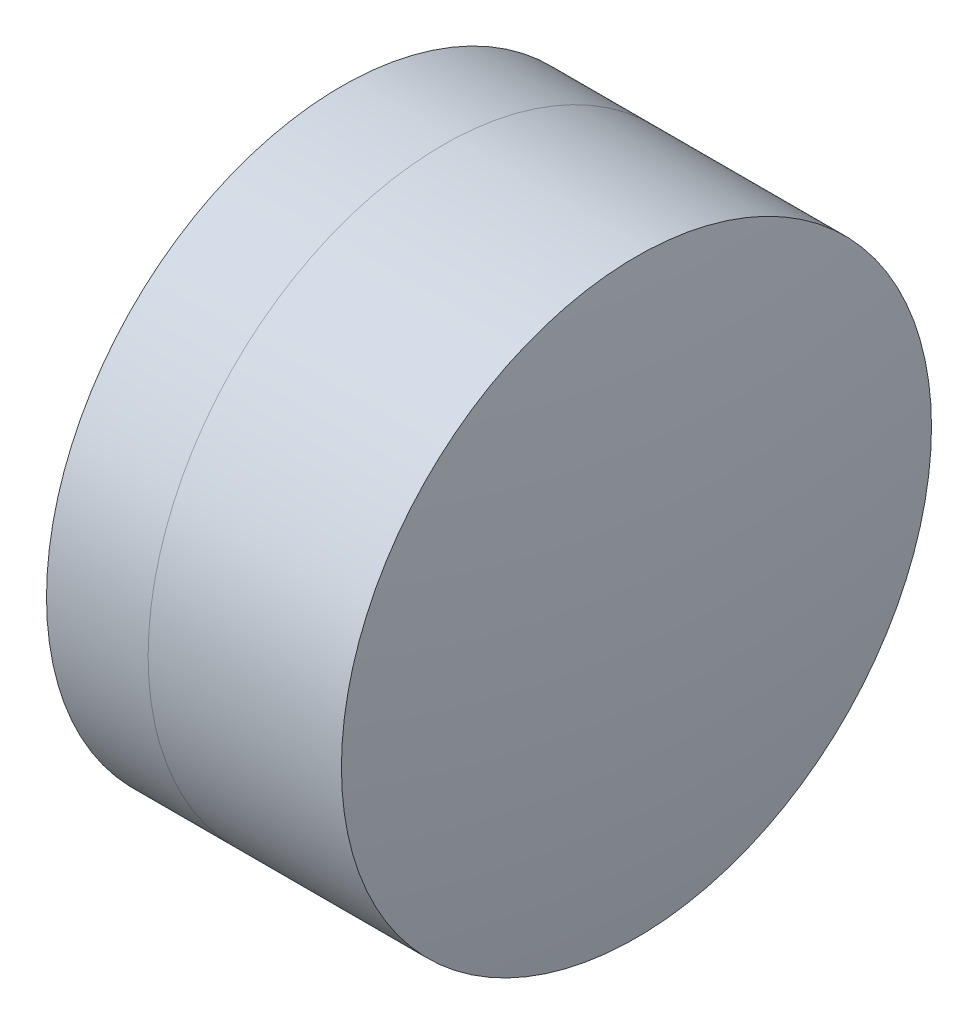
ISO-10303-21;
HEADER;
FILE_DESCRIPTION(('STEP AP214'),'2;1');
FILE_NAME('part.step','',(''),(''),'','','');
FILE_SCHEMA(('AUTOMOTIVE_DESIGN { 1 0 10303 214 1 1 1 1 }'));
ENDSEC;
DATA;
#1=APPLICATION_CONTEXT('core data for automotive mechanical design processes');
#2=APPLICATION_PROTOCOL_DEFINITION('international standard','automotive_design',2000,#1);
#3=PRODUCT_CONTEXT('',#1,'mechanical');
#4=PRODUCT('Part','Part','',(#3));
#5=PRODUCT_RELATED_PRODUCT_CATEGORY('part','',(#4));
#6=PRODUCT_DEFINITION_FORMATION('','',#4);
#7=PRODUCT_DEFINITION_CONTEXT('part definition',#1,'design');
#8=PRODUCT_DEFINITION('design','',#6,#7);
#9=PRODUCT_DEFINITION_SHAPE('','',#8);
#10=(LENGTH_UNIT() NAMED_UNIT(*) SI_UNIT(.MILLI.,.METRE.));
#11=(NAMED_UNIT(*) PLANE_ANGLE_UNIT() SI_UNIT($,.RADIAN.));
#12=(NAMED_UNIT(*) SI_UNIT($,.STERADIAN.) SOLID_ANGLE_UNIT());
#13=UNCERTAINTY_MEASURE_WITH_UNIT(LENGTH_MEASURE(1.E-05),#10,'distance_accuracy_value','');
#14=(GEOMETRIC_REPRESENTATION_CONTEXT(3) GLOBAL_UNCERTAINTY_ASSIGNED_CONTEXT((#13)) GLOBAL_UNIT_ASSIGNED_CONTEXT((#10,
#11,#12)) REPRESENTATION_CONTEXT('',''));
#15=CARTESIAN_POINT('',(0.,0.,0.));
#16=DIRECTION('',(0.,0.,1.));
#17=DIRECTION('',(1.,0.,0.));
#18=AXIS2_PLACEMENT_3D('',#15,#16,#17);
#19=CARTESIAN_POINT('',(-5.05256057380979,0.,0.));
#20=DIRECTION('',(-1.,0.,0.));
#21=DIRECTION('',(0.,0.,1.));
#22=AXIS2_PLACEMENT_3D('',#19,#20,#21);
#23=SPHERICAL_SURFACE('',#22,6.6);
#24=CARTESIAN_POINT('',(0.733575874633153,0.,0.));
#25=DIRECTION('',(-1.,0.,0.));
#26=DIRECTION('',(0.,0.,1.));
#27=AXIS2_PLACEMENT_3D('',#24,#25,#26);
#28=CIRCLE('',#27,3.175);
#29=CARTESIAN_POINT('',(0.733575874633153,0.,3.175));
#30=VERTEX_POINT('',#29);
#31=EDGE_CURVE('E11',#30,#30,#28,.T.);
#32=ORIENTED_EDGE('',*,*,#31,.T.);
#33=EDGE_LOOP('',(#32));
#34=FACE_BOUND('',#33,.T.);
#35=ADVANCED_FACE('F51',(#34),#23,.F.);
#36=CARTESIAN_POINT('',(-0.551919992657797,0.,0.));
#37=DIRECTION('',(-1.,0.,0.));
#38=DIRECTION('',(0.,0.,1.));
#39=AXIS2_PLACEMENT_3D('',#36,#37,#38);
#40=CYLINDRICAL_SURFACE('',#39,3.175);
#41=CARTESIAN_POINT('',(2.81391037509096,0.,0.));
#42=DIRECTION('',(-1.,0.,0.));
#43=DIRECTION('',(0.,0.,1.));
#44=AXIS2_PLACEMENT_3D('',#41,#42,#43);
#45=CIRCLE('',#44,3.175);
#46=CARTESIAN_POINT('',(2.81391037509096,0.,3.175));
#47=VERTEX_POINT('',#46);
#48=EDGE_CURVE('E58',#47,#47,#45,.T.);
#49=ORIENTED_EDGE('',*,*,#48,.T.);
#50=EDGE_LOOP('',(#49));
#51=FACE_BOUND('',#50,.T.);
#52=ORIENTED_EDGE('',*,*,#31,.F.);
#53=EDGE_LOOP('',(#52));
#54=FACE_BOUND('',#53,.T.);
#55=ADVANCED_FACE('F65',(#51,#54),#40,.T.);
#56=CARTESIAN_POINT('',(-18.6525605738098,0.,0.));
#57=DIRECTION('',(-1.,0.,0.));
#58=DIRECTION('',(0.,0.,1.));
#59=AXIS2_PLACEMENT_3D('',#56,#57,#58);
#60=SPHERICAL_SURFACE('',#59,21.7);
#61=ORIENTED_EDGE('',*,*,#48,.F.);
#62=EDGE_LOOP('',(#61));
#63=FACE_BOUND('',#62,.T.);
#64=ADVANCED_FACE('F68',(#63),#60,.T.);
#65=CLOSED_SHELL('',(#35,#55,#64));
#66=MANIFOLD_SOLID_BREP('B2',#65);
#67=CARTESIAN_POINT('',(7.84743942619021,0.,0.));
#68=DIRECTION('',(-1.,0.,0.));
#69=DIRECTION('',(0.,0.,-1.));
#70=AXIS2_PLACEMENT_3D('',#67,#68,#69);
#71=SPHERICAL_SURFACE('',#70,8.8);
#72=CARTESIAN_POINT('',(-0.359836309399527,0.,0.));
#73=DIRECTION('',(-1.,0.,0.));
#74=DIRECTION('',(0.,0.,1.));
#75=AXIS2_PLACEMENT_3D('',#72,#73,#74);
#76=CIRCLE('',#75,3.175);
#77=CARTESIAN_POINT('',(-0.359836309399527,0.,3.175));
#78=VERTEX_POINT('',#77);
#79=EDGE_CURVE('E50',#78,#78,#76,.T.);
#80=ORIENTED_EDGE('',*,*,#79,.T.);
#81=EDGE_LOOP('',(#80));
#82=FACE_BOUND('',#81,.T.);
#83=ADVANCED_FACE('F97',(#82),#71,.T.);
#84=CARTESIAN_POINT('',(-9.70261217833668,0.,0.));
#85=DIRECTION('',(-1.,0.,0.));
#86=DIRECTION('',(0.,0.,1.));
#87=AXIS2_PLACEMENT_3D('',#84,#85,#86);
#88=CYLINDRICAL_SURFACE('',#87,3.175);
#89=CARTESIAN_POINT('',(0.733575874633158,0.,0.));
#90=DIRECTION('',(-1.,0.,0.));
#91=DIRECTION('',(0.,0.,1.));
#92=AXIS2_PLACEMENT_3D('',#89,#90,#91);
#93=CIRCLE('',#92,3.175);
#94=CARTESIAN_POINT('',(0.733575874633158,0.,3.175));
#95=VERTEX_POINT('',#94);
#96=EDGE_CURVE('E104',#95,#95,#93,.T.);
#97=ORIENTED_EDGE('',*,*,#96,.T.);
#98=EDGE_LOOP('',(#97));
#99=FACE_BOUND('',#98,.T.);
#100=ORIENTED_EDGE('',*,*,#79,.F.);
#101=EDGE_LOOP('',(#100));
#102=FACE_BOUND('',#101,.T.);
#103=ADVANCED_FACE('F111',(#99,#102),#88,.T.);
#104=CARTESIAN_POINT('',(-5.05256057380979,0.,0.));
#105=DIRECTION('',(-1.,0.,0.));
#106=DIRECTION('',(0.,0.,1.));
#107=AXIS2_PLACEMENT_3D('',#104,#105,#106);
#108=SPHERICAL_SURFACE('',#107,6.6);
#109=ORIENTED_EDGE('',*,*,#96,.F.);
#110=EDGE_LOOP('',(#109));
#111=FACE_BOUND('',#110,.T.);
#112=ADVANCED_FACE('F114',(#111),#108,.T.);
#113=CLOSED_SHELL('',(#83,#103,#112));
#114=MANIFOLD_SOLID_BREP('B6',#113);
#115=ADVANCED_BREP_SHAPE_REPRESENTATION('',(#18,#66,#114),#14);
#116=SHAPE_DEFINITION_REPRESENTATION(#9,#115);
ENDSEC;
END-ISO-10303-21;
